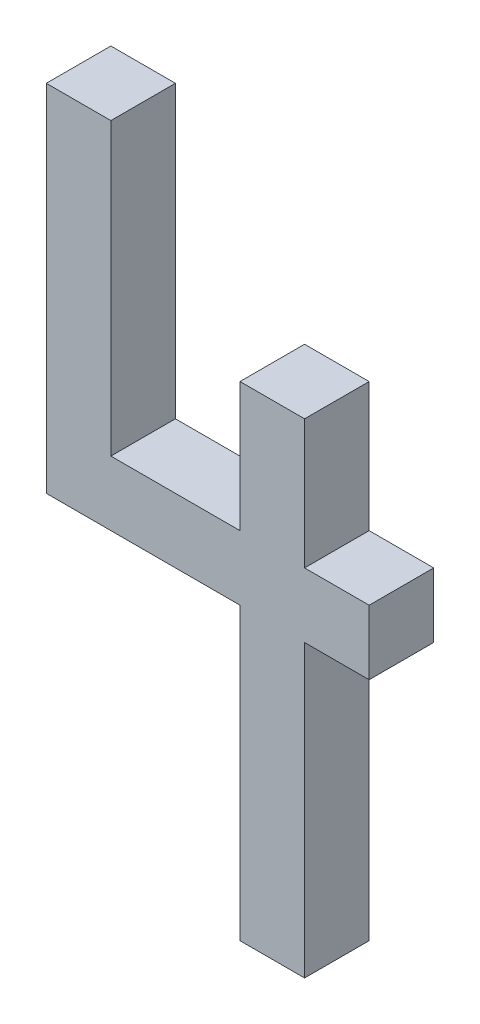
ISO-10303-21;
HEADER;
FILE_DESCRIPTION(('STEP AP214'),'2;1');
FILE_NAME('part.step','',(''),(''),'','','');
FILE_SCHEMA(('AUTOMOTIVE_DESIGN { 1 0 10303 214 1 1 1 1 }'));
ENDSEC;
DATA;
#1=APPLICATION_CONTEXT('core data for automotive mechanical design processes');
#2=APPLICATION_PROTOCOL_DEFINITION('international standard','automotive_design',2000,#1);
#3=PRODUCT_CONTEXT('',#1,'mechanical');
#4=PRODUCT('Part','Part','',(#3));
#5=PRODUCT_RELATED_PRODUCT_CATEGORY('part','',(#4));
#6=PRODUCT_DEFINITION_FORMATION('','',#4);
#7=PRODUCT_DEFINITION_CONTEXT('part definition',#1,'design');
#8=PRODUCT_DEFINITION('design','',#6,#7);
#9=PRODUCT_DEFINITION_SHAPE('','',#8);
#10=(LENGTH_UNIT() NAMED_UNIT(*) SI_UNIT(.MILLI.,.METRE.));
#11=(NAMED_UNIT(*) PLANE_ANGLE_UNIT() SI_UNIT($,.RADIAN.));
#12=(NAMED_UNIT(*) SI_UNIT($,.STERADIAN.) SOLID_ANGLE_UNIT());
#13=UNCERTAINTY_MEASURE_WITH_UNIT(LENGTH_MEASURE(1.E-05),#10,'distance_accuracy_value','');
#14=(GEOMETRIC_REPRESENTATION_CONTEXT(3) GLOBAL_UNCERTAINTY_ASSIGNED_CONTEXT((#13)) GLOBAL_UNIT_ASSIGNED_CONTEXT((#10,
#11,#12)) REPRESENTATION_CONTEXT('',''));
#15=CARTESIAN_POINT('',(0.,0.,0.));
#16=DIRECTION('',(0.,0.,1.));
#17=DIRECTION('',(1.,0.,0.));
#18=AXIS2_PLACEMENT_3D('',#15,#16,#17);
#19=CARTESIAN_POINT('',(-0.06349999999999,0.127,0.0254));
#20=DIRECTION('',(0.,0.,1.));
#21=DIRECTION('',(1.,0.,0.));
#22=AXIS2_PLACEMENT_3D('',#19,#20,#21);
#23=PLANE('',#22);
#24=DIRECTION('',(0.,1.,0.));
#25=VECTOR('',#24,1.);
#26=CARTESIAN_POINT('',(-0.0381,0.127,0.0254));
#27=LINE('',#26,#25);
#28=CARTESIAN_POINT('',(-0.0381,0.127,0.0254));
#29=VERTEX_POINT('',#28);
#30=CARTESIAN_POINT('',(-0.0381,0.0127,0.0254));
#31=VERTEX_POINT('',#30);
#32=EDGE_CURVE('E177',#29,#31,#27,.F.);
#33=ORIENTED_EDGE('',*,*,#32,.F.);
#34=DIRECTION('',(1.,0.,0.));
#35=VECTOR('',#34,1.);
#36=CARTESIAN_POINT('',(-0.06349999999999,0.127,0.0254));
#37=LINE('',#36,#35);
#38=CARTESIAN_POINT('',(-0.06349999999999,0.127,0.0254));
#39=VERTEX_POINT('',#38);
#40=EDGE_CURVE('E130',#39,#29,#37,.T.);
#41=ORIENTED_EDGE('',*,*,#40,.F.);
#42=DIRECTION('',(0.,1.,0.));
#43=VECTOR('',#42,1.);
#44=CARTESIAN_POINT('',(-0.06349999999999,-0.0127,0.0254));
#45=LINE('',#44,#43);
#46=CARTESIAN_POINT('',(-0.06349999999999,-0.0127,0.0254));
#47=VERTEX_POINT('',#46);
#48=EDGE_CURVE('E20',#47,#39,#45,.T.);
#49=ORIENTED_EDGE('',*,*,#48,.F.);
#50=DIRECTION('',(1.,0.,0.));
#51=VECTOR('',#50,1.);
#52=CARTESIAN_POINT('',(0.01270000000001,-0.0127,0.0254));
#53=LINE('',#52,#51);
#54=CARTESIAN_POINT('',(0.01270000000001,-0.0127,0.0254));
#55=VERTEX_POINT('',#54);
#56=EDGE_CURVE('E119',#55,#47,#53,.F.);
#57=ORIENTED_EDGE('',*,*,#56,.F.);
#58=DIRECTION('',(0.,1.,0.));
#59=VECTOR('',#58,1.);
#60=CARTESIAN_POINT('',(0.01270000000001,-0.127,0.0254));
#61=LINE('',#60,#59);
#62=CARTESIAN_POINT('',(0.01270000000001,-0.127,0.0254));
#63=VERTEX_POINT('',#62);
#64=EDGE_CURVE('E114',#63,#55,#61,.T.);
#65=ORIENTED_EDGE('',*,*,#64,.F.);
#66=DIRECTION('',(1.,0.,0.));
#67=VECTOR('',#66,1.);
#68=CARTESIAN_POINT('',(0.0381,-0.127,0.0254));
#69=LINE('',#68,#67);
#70=CARTESIAN_POINT('',(0.0381,-0.127,0.0254));
#71=VERTEX_POINT('',#70);
#72=EDGE_CURVE('E141',#71,#63,#69,.F.);
#73=ORIENTED_EDGE('',*,*,#72,.F.);
#74=DIRECTION('',(0.,1.,0.));
#75=VECTOR('',#74,1.);
#76=CARTESIAN_POINT('',(0.0381,-0.0127,0.0254));
#77=LINE('',#76,#75);
#78=CARTESIAN_POINT('',(0.0381,-0.0127,0.0254));
#79=VERTEX_POINT('',#78);
#80=EDGE_CURVE('E145',#79,#71,#77,.F.);
#81=ORIENTED_EDGE('',*,*,#80,.F.);
#82=DIRECTION('',(1.,0.,0.));
#83=VECTOR('',#82,1.);
#84=CARTESIAN_POINT('',(0.0635,-0.0127,0.0254));
#85=LINE('',#84,#83);
#86=CARTESIAN_POINT('',(0.0635,-0.0127,0.0254));
#87=VERTEX_POINT('',#86);
#88=EDGE_CURVE('E149',#87,#79,#85,.F.);
#89=ORIENTED_EDGE('',*,*,#88,.F.);
#90=DIRECTION('',(0.,1.,0.));
#91=VECTOR('',#90,1.);
#92=CARTESIAN_POINT('',(0.0635,0.0127,0.0254));
#93=LINE('',#92,#91);
#94=CARTESIAN_POINT('',(0.0635,0.0127,0.0254));
#95=VERTEX_POINT('',#94);
#96=EDGE_CURVE('E153',#95,#87,#93,.F.);
#97=ORIENTED_EDGE('',*,*,#96,.F.);
#98=DIRECTION('',(1.,0.,0.));
#99=VECTOR('',#98,1.);
#100=CARTESIAN_POINT('',(0.0381,0.0127,0.0254));
#101=LINE('',#100,#99);
#102=CARTESIAN_POINT('',(0.0381,0.0127,0.0254));
#103=VERTEX_POINT('',#102);
#104=EDGE_CURVE('E157',#103,#95,#101,.T.);
#105=ORIENTED_EDGE('',*,*,#104,.F.);
#106=DIRECTION('',(0.,1.,0.));
#107=VECTOR('',#106,1.);
#108=CARTESIAN_POINT('',(0.0381,0.0635,0.0254));
#109=LINE('',#108,#107);
#110=CARTESIAN_POINT('',(0.0381,0.0635,0.0254));
#111=VERTEX_POINT('',#110);
#112=EDGE_CURVE('E161',#111,#103,#109,.F.);
#113=ORIENTED_EDGE('',*,*,#112,.F.);
#114=DIRECTION('',(1.,0.,0.));
#115=VECTOR('',#114,1.);
#116=CARTESIAN_POINT('',(0.01270000000001,0.0635,0.0254));
#117=LINE('',#116,#115);
#118=CARTESIAN_POINT('',(0.01270000000001,0.0635,0.0254));
#119=VERTEX_POINT('',#118);
#120=EDGE_CURVE('E165',#119,#111,#117,.T.);
#121=ORIENTED_EDGE('',*,*,#120,.F.);
#122=DIRECTION('',(0.,1.,0.));
#123=VECTOR('',#122,1.);
#124=CARTESIAN_POINT('',(0.01270000000001,0.0127,0.0254));
#125=LINE('',#124,#123);
#126=CARTESIAN_POINT('',(0.01270000000001,0.0127,0.0254));
#127=VERTEX_POINT('',#126);
#128=EDGE_CURVE('E169',#127,#119,#125,.T.);
#129=ORIENTED_EDGE('',*,*,#128,.F.);
#130=DIRECTION('',(1.,0.,0.));
#131=VECTOR('',#130,1.);
#132=CARTESIAN_POINT('',(-0.0381,0.0127,0.0254));
#133=LINE('',#132,#131);
#134=EDGE_CURVE('E173',#31,#127,#133,.T.);
#135=ORIENTED_EDGE('',*,*,#134,.F.);
#136=EDGE_LOOP('',(#33,#41,#49,#57,#65,#73,#81,#89,#97,#105,#113,#121,#129,#135));
#137=FACE_BOUND('',#136,.T.);
#138=ADVANCED_FACE('F17',(#137),#23,.T.);
#139=CARTESIAN_POINT('',(-0.06349999999999,-0.0127,0.));
#140=DIRECTION('',(-1.,0.,0.));
#141=DIRECTION('',(0.,0.,1.));
#142=AXIS2_PLACEMENT_3D('',#139,#140,#141);
#143=PLANE('',#142);
#144=DIRECTION('',(0.,0.,1.));
#145=VECTOR('',#144,1.);
#146=CARTESIAN_POINT('',(-0.06349999999999,0.127,0.));
#147=LINE('',#146,#145);
#148=CARTESIAN_POINT('',(-0.06349999999999,0.127,0.));
#149=VERTEX_POINT('',#148);
#150=EDGE_CURVE('E181',#149,#39,#147,.T.);
#151=ORIENTED_EDGE('',*,*,#150,.F.);
#152=DIRECTION('',(0.,1.,0.));
#153=VECTOR('',#152,1.);
#154=CARTESIAN_POINT('',(-0.06349999999999,0.127,0.));
#155=LINE('',#154,#153);
#156=CARTESIAN_POINT('',(-0.06349999999999,-0.0127,0.));
#157=VERTEX_POINT('',#156);
#158=EDGE_CURVE('E136',#149,#157,#155,.F.);
#159=ORIENTED_EDGE('',*,*,#158,.T.);
#160=DIRECTION('',(0.,0.,-1.));
#161=VECTOR('',#160,1.);
#162=CARTESIAN_POINT('',(-0.06349999999999,-0.0127,0.));
#163=LINE('',#162,#161);
#164=EDGE_CURVE('E124',#47,#157,#163,.T.);
#165=ORIENTED_EDGE('',*,*,#164,.F.);
#166=ORIENTED_EDGE('',*,*,#48,.T.);
#167=EDGE_LOOP('',(#151,#159,#165,#166));
#168=FACE_BOUND('',#167,.T.);
#169=ADVANCED_FACE('F135',(#168),#143,.T.);
#170=CARTESIAN_POINT('',(0.01270000000001,-0.0127,0.));
#171=DIRECTION('',(0.,-1.,0.));
#172=DIRECTION('',(0.,0.,-1.));
#173=AXIS2_PLACEMENT_3D('',#170,#171,#172);
#174=PLANE('',#173);
#175=ORIENTED_EDGE('',*,*,#164,.T.);
#176=DIRECTION('',(1.,0.,0.));
#177=VECTOR('',#176,1.);
#178=CARTESIAN_POINT('',(-0.06349999999999,-0.0127,0.));
#179=LINE('',#178,#177);
#180=CARTESIAN_POINT('',(0.01270000000001,-0.0127,0.));
#181=VERTEX_POINT('',#180);
#182=EDGE_CURVE('E186',#157,#181,#179,.T.);
#183=ORIENTED_EDGE('',*,*,#182,.T.);
#184=DIRECTION('',(0.,0.,1.));
#185=VECTOR('',#184,1.);
#186=CARTESIAN_POINT('',(0.01270000000001,-0.0127,0.));
#187=LINE('',#186,#185);
#188=EDGE_CURVE('E126',#55,#181,#187,.F.);
#189=ORIENTED_EDGE('',*,*,#188,.F.);
#190=ORIENTED_EDGE('',*,*,#56,.T.);
#191=EDGE_LOOP('',(#175,#183,#189,#190));
#192=FACE_BOUND('',#191,.T.);
#193=ADVANCED_FACE('F121',(#192),#174,.T.);
#194=CARTESIAN_POINT('',(0.01270000000001,-0.127,0.));
#195=DIRECTION('',(-1.,0.,0.));
#196=DIRECTION('',(0.,0.,1.));
#197=AXIS2_PLACEMENT_3D('',#194,#195,#196);
#198=PLANE('',#197);
#199=ORIENTED_EDGE('',*,*,#188,.T.);
#200=DIRECTION('',(0.,1.,0.));
#201=VECTOR('',#200,1.);
#202=CARTESIAN_POINT('',(0.01270000000001,0.127,0.));
#203=LINE('',#202,#201);
#204=CARTESIAN_POINT('',(0.01270000000001,-0.127,0.));
#205=VERTEX_POINT('',#204);
#206=EDGE_CURVE('E188',#181,#205,#203,.F.);
#207=ORIENTED_EDGE('',*,*,#206,.T.);
#208=DIRECTION('',(0.,0.,-1.));
#209=VECTOR('',#208,1.);
#210=CARTESIAN_POINT('',(0.01270000000001,-0.127,0.));
#211=LINE('',#210,#209);
#212=EDGE_CURVE('E143',#63,#205,#211,.T.);
#213=ORIENTED_EDGE('',*,*,#212,.F.);
#214=ORIENTED_EDGE('',*,*,#64,.T.);
#215=EDGE_LOOP('',(#199,#207,#213,#214));
#216=FACE_BOUND('',#215,.T.);
#217=ADVANCED_FACE('F270',(#216),#198,.T.);
#218=CARTESIAN_POINT('',(0.0381,-0.127,0.));
#219=DIRECTION('',(0.,-1.,0.));
#220=DIRECTION('',(0.,0.,-1.));
#221=AXIS2_PLACEMENT_3D('',#218,#219,#220);
#222=PLANE('',#221);
#223=ORIENTED_EDGE('',*,*,#212,.T.);
#224=DIRECTION('',(1.,0.,0.));
#225=VECTOR('',#224,1.);
#226=CARTESIAN_POINT('',(-0.06349999999999,-0.127,0.));
#227=LINE('',#226,#225);
#228=CARTESIAN_POINT('',(0.0381,-0.127,0.));
#229=VERTEX_POINT('',#228);
#230=EDGE_CURVE('E191',#205,#229,#227,.T.);
#231=ORIENTED_EDGE('',*,*,#230,.T.);
#232=DIRECTION('',(0.,0.,-1.));
#233=VECTOR('',#232,1.);
#234=CARTESIAN_POINT('',(0.0381,-0.127,0.));
#235=LINE('',#234,#233);
#236=EDGE_CURVE('E147',#71,#229,#235,.T.);
#237=ORIENTED_EDGE('',*,*,#236,.F.);
#238=ORIENTED_EDGE('',*,*,#72,.T.);
#239=EDGE_LOOP('',(#223,#231,#237,#238));
#240=FACE_BOUND('',#239,.T.);
#241=ADVANCED_FACE('F269',(#240),#222,.T.);
#242=CARTESIAN_POINT('',(0.0381,-0.0127,0.));
#243=DIRECTION('',(1.,0.,0.));
#244=DIRECTION('',(0.,0.,-1.));
#245=AXIS2_PLACEMENT_3D('',#242,#243,#244);
#246=PLANE('',#245);
#247=ORIENTED_EDGE('',*,*,#236,.T.);
#248=DIRECTION('',(0.,1.,0.));
#249=VECTOR('',#248,1.);
#250=CARTESIAN_POINT('',(0.0381,0.127,0.));
#251=LINE('',#250,#249);
#252=CARTESIAN_POINT('',(0.0381,-0.0127,0.));
#253=VERTEX_POINT('',#252);
#254=EDGE_CURVE('E194',#229,#253,#251,.T.);
#255=ORIENTED_EDGE('',*,*,#254,.T.);
#256=DIRECTION('',(0.,0.,-1.));
#257=VECTOR('',#256,1.);
#258=CARTESIAN_POINT('',(0.0381,-0.0127,0.));
#259=LINE('',#258,#257);
#260=EDGE_CURVE('E151',#79,#253,#259,.T.);
#261=ORIENTED_EDGE('',*,*,#260,.F.);
#262=ORIENTED_EDGE('',*,*,#80,.T.);
#263=EDGE_LOOP('',(#247,#255,#261,#262));
#264=FACE_BOUND('',#263,.T.);
#265=ADVANCED_FACE('F263',(#264),#246,.T.);
#266=CARTESIAN_POINT('',(0.0635,-0.0127,0.));
#267=DIRECTION('',(0.,-1.,0.));
#268=DIRECTION('',(0.,0.,-1.));
#269=AXIS2_PLACEMENT_3D('',#266,#267,#268);
#270=PLANE('',#269);
#271=ORIENTED_EDGE('',*,*,#260,.T.);
#272=DIRECTION('',(1.,0.,0.));
#273=VECTOR('',#272,1.);
#274=CARTESIAN_POINT('',(-0.06349999999999,-0.0127,0.));
#275=LINE('',#274,#273);
#276=CARTESIAN_POINT('',(0.0635,-0.0127,0.));
#277=VERTEX_POINT('',#276);
#278=EDGE_CURVE('E197',#253,#277,#275,.T.);
#279=ORIENTED_EDGE('',*,*,#278,.T.);
#280=DIRECTION('',(0.,0.,-1.));
#281=VECTOR('',#280,1.);
#282=CARTESIAN_POINT('',(0.0635,-0.0127,0.));
#283=LINE('',#282,#281);
#284=EDGE_CURVE('E155',#87,#277,#283,.T.);
#285=ORIENTED_EDGE('',*,*,#284,.F.);
#286=ORIENTED_EDGE('',*,*,#88,.T.);
#287=EDGE_LOOP('',(#271,#279,#285,#286));
#288=FACE_BOUND('',#287,.T.);
#289=ADVANCED_FACE('F259',(#288),#270,.T.);
#290=CARTESIAN_POINT('',(0.0635,0.0127,0.));
#291=DIRECTION('',(1.,0.,0.));
#292=DIRECTION('',(0.,0.,-1.));
#293=AXIS2_PLACEMENT_3D('',#290,#291,#292);
#294=PLANE('',#293);
#295=ORIENTED_EDGE('',*,*,#284,.T.);
#296=DIRECTION('',(0.,1.,0.));
#297=VECTOR('',#296,1.);
#298=CARTESIAN_POINT('',(0.0635,0.127,0.));
#299=LINE('',#298,#297);
#300=CARTESIAN_POINT('',(0.0635,0.0127,0.));
#301=VERTEX_POINT('',#300);
#302=EDGE_CURVE('E200',#277,#301,#299,.T.);
#303=ORIENTED_EDGE('',*,*,#302,.T.);
#304=DIRECTION('',(0.,0.,1.));
#305=VECTOR('',#304,1.);
#306=CARTESIAN_POINT('',(0.0635,0.0127,0.));
#307=LINE('',#306,#305);
#308=EDGE_CURVE('E159',#95,#301,#307,.F.);
#309=ORIENTED_EDGE('',*,*,#308,.F.);
#310=ORIENTED_EDGE('',*,*,#96,.T.);
#311=EDGE_LOOP('',(#295,#303,#309,#310));
#312=FACE_BOUND('',#311,.T.);
#313=ADVANCED_FACE('F253',(#312),#294,.T.);
#314=CARTESIAN_POINT('',(0.0381,0.0127,0.));
#315=DIRECTION('',(0.,1.,0.));
#316=DIRECTION('',(0.,0.,1.));
#317=AXIS2_PLACEMENT_3D('',#314,#315,#316);
#318=PLANE('',#317);
#319=ORIENTED_EDGE('',*,*,#308,.T.);
#320=DIRECTION('',(1.,0.,0.));
#321=VECTOR('',#320,1.);
#322=CARTESIAN_POINT('',(-0.06349999999999,0.0127,0.));
#323=LINE('',#322,#321);
#324=CARTESIAN_POINT('',(0.0381,0.0127,0.));
#325=VERTEX_POINT('',#324);
#326=EDGE_CURVE('E203',#301,#325,#323,.F.);
#327=ORIENTED_EDGE('',*,*,#326,.T.);
#328=DIRECTION('',(0.,0.,-1.));
#329=VECTOR('',#328,1.);
#330=CARTESIAN_POINT('',(0.0381,0.0127,0.));
#331=LINE('',#330,#329);
#332=EDGE_CURVE('E163',#103,#325,#331,.T.);
#333=ORIENTED_EDGE('',*,*,#332,.F.);
#334=ORIENTED_EDGE('',*,*,#104,.T.);
#335=EDGE_LOOP('',(#319,#327,#333,#334));
#336=FACE_BOUND('',#335,.T.);
#337=ADVANCED_FACE('F249',(#336),#318,.T.);
#338=CARTESIAN_POINT('',(0.0381,0.0635,0.));
#339=DIRECTION('',(1.,0.,0.));
#340=DIRECTION('',(0.,0.,-1.));
#341=AXIS2_PLACEMENT_3D('',#338,#339,#340);
#342=PLANE('',#341);
#343=ORIENTED_EDGE('',*,*,#332,.T.);
#344=DIRECTION('',(0.,1.,0.));
#345=VECTOR('',#344,1.);
#346=CARTESIAN_POINT('',(0.0381,0.127,0.));
#347=LINE('',#346,#345);
#348=CARTESIAN_POINT('',(0.0381,0.0635,0.));
#349=VERTEX_POINT('',#348);
#350=EDGE_CURVE('E206',#325,#349,#347,.T.);
#351=ORIENTED_EDGE('',*,*,#350,.T.);
#352=DIRECTION('',(0.,0.,1.));
#353=VECTOR('',#352,1.);
#354=CARTESIAN_POINT('',(0.0381,0.0635,0.));
#355=LINE('',#354,#353);
#356=EDGE_CURVE('E167',#111,#349,#355,.F.);
#357=ORIENTED_EDGE('',*,*,#356,.F.);
#358=ORIENTED_EDGE('',*,*,#112,.T.);
#359=EDGE_LOOP('',(#343,#351,#357,#358));
#360=FACE_BOUND('',#359,.T.);
#361=ADVANCED_FACE('F243',(#360),#342,.T.);
#362=CARTESIAN_POINT('',(0.01270000000001,0.0635,0.));
#363=DIRECTION('',(0.,1.,0.));
#364=DIRECTION('',(0.,0.,1.));
#365=AXIS2_PLACEMENT_3D('',#362,#363,#364);
#366=PLANE('',#365);
#367=ORIENTED_EDGE('',*,*,#356,.T.);
#368=DIRECTION('',(1.,0.,0.));
#369=VECTOR('',#368,1.);
#370=CARTESIAN_POINT('',(-0.06349999999999,0.0635,0.));
#371=LINE('',#370,#369);
#372=CARTESIAN_POINT('',(0.01270000000001,0.0635,0.));
#373=VERTEX_POINT('',#372);
#374=EDGE_CURVE('E209',#349,#373,#371,.F.);
#375=ORIENTED_EDGE('',*,*,#374,.T.);
#376=DIRECTION('',(0.,0.,1.));
#377=VECTOR('',#376,1.);
#378=CARTESIAN_POINT('',(0.01270000000001,0.0635,0.));
#379=LINE('',#378,#377);
#380=EDGE_CURVE('E171',#119,#373,#379,.F.);
#381=ORIENTED_EDGE('',*,*,#380,.F.);
#382=ORIENTED_EDGE('',*,*,#120,.T.);
#383=EDGE_LOOP('',(#367,#375,#381,#382));
#384=FACE_BOUND('',#383,.T.);
#385=ADVANCED_FACE('F239',(#384),#366,.T.);
#386=CARTESIAN_POINT('',(0.01270000000001,0.0127,0.));
#387=DIRECTION('',(-1.,0.,0.));
#388=DIRECTION('',(0.,0.,1.));
#389=AXIS2_PLACEMENT_3D('',#386,#387,#388);
#390=PLANE('',#389);
#391=ORIENTED_EDGE('',*,*,#380,.T.);
#392=DIRECTION('',(0.,1.,0.));
#393=VECTOR('',#392,1.);
#394=CARTESIAN_POINT('',(0.01270000000001,0.127,0.));
#395=LINE('',#394,#393);
#396=CARTESIAN_POINT('',(0.01270000000001,0.0127,0.));
#397=VERTEX_POINT('',#396);
#398=EDGE_CURVE('E212',#373,#397,#395,.F.);
#399=ORIENTED_EDGE('',*,*,#398,.T.);
#400=DIRECTION('',(0.,0.,1.));
#401=VECTOR('',#400,1.);
#402=CARTESIAN_POINT('',(0.01270000000001,0.0127,0.));
#403=LINE('',#402,#401);
#404=EDGE_CURVE('E175',#127,#397,#403,.F.);
#405=ORIENTED_EDGE('',*,*,#404,.F.);
#406=ORIENTED_EDGE('',*,*,#128,.T.);
#407=EDGE_LOOP('',(#391,#399,#405,#406));
#408=FACE_BOUND('',#407,.T.);
#409=ADVANCED_FACE('F233',(#408),#390,.T.);
#410=CARTESIAN_POINT('',(-0.0381,0.0127,0.));
#411=DIRECTION('',(0.,1.,0.));
#412=DIRECTION('',(0.,0.,1.));
#413=AXIS2_PLACEMENT_3D('',#410,#411,#412);
#414=PLANE('',#413);
#415=ORIENTED_EDGE('',*,*,#404,.T.);
#416=DIRECTION('',(1.,0.,0.));
#417=VECTOR('',#416,1.);
#418=CARTESIAN_POINT('',(-0.06349999999999,0.0127,0.));
#419=LINE('',#418,#417);
#420=CARTESIAN_POINT('',(-0.0381,0.0127,0.));
#421=VERTEX_POINT('',#420);
#422=EDGE_CURVE('E215',#397,#421,#419,.F.);
#423=ORIENTED_EDGE('',*,*,#422,.T.);
#424=DIRECTION('',(0.,0.,-1.));
#425=VECTOR('',#424,1.);
#426=CARTESIAN_POINT('',(-0.0381,0.0127,0.));
#427=LINE('',#426,#425);
#428=EDGE_CURVE('E179',#31,#421,#427,.T.);
#429=ORIENTED_EDGE('',*,*,#428,.F.);
#430=ORIENTED_EDGE('',*,*,#134,.T.);
#431=EDGE_LOOP('',(#415,#423,#429,#430));
#432=FACE_BOUND('',#431,.T.);
#433=ADVANCED_FACE('F228',(#432),#414,.T.);
#434=CARTESIAN_POINT('',(-0.0381,0.127,0.));
#435=DIRECTION('',(1.,0.,0.));
#436=DIRECTION('',(0.,0.,-1.));
#437=AXIS2_PLACEMENT_3D('',#434,#435,#436);
#438=PLANE('',#437);
#439=ORIENTED_EDGE('',*,*,#428,.T.);
#440=DIRECTION('',(0.,1.,0.));
#441=VECTOR('',#440,1.);
#442=CARTESIAN_POINT('',(-0.0381,0.127,0.));
#443=LINE('',#442,#441);
#444=CARTESIAN_POINT('',(-0.0381,0.127,0.));
#445=VERTEX_POINT('',#444);
#446=EDGE_CURVE('E26',#421,#445,#443,.T.);
#447=ORIENTED_EDGE('',*,*,#446,.T.);
#448=DIRECTION('',(0.,0.,1.));
#449=VECTOR('',#448,1.);
#450=CARTESIAN_POINT('',(-0.0381,0.127,0.));
#451=LINE('',#450,#449);
#452=EDGE_CURVE('E34',#29,#445,#451,.F.);
#453=ORIENTED_EDGE('',*,*,#452,.F.);
#454=ORIENTED_EDGE('',*,*,#32,.T.);
#455=EDGE_LOOP('',(#439,#447,#453,#454));
#456=FACE_BOUND('',#455,.T.);
#457=ADVANCED_FACE('F221',(#456),#438,.T.);
#458=CARTESIAN_POINT('',(-0.06349999999999,0.127,0.));
#459=DIRECTION('',(0.,1.,0.));
#460=DIRECTION('',(0.,0.,1.));
#461=AXIS2_PLACEMENT_3D('',#458,#459,#460);
#462=PLANE('',#461);
#463=ORIENTED_EDGE('',*,*,#452,.T.);
#464=DIRECTION('',(1.,0.,0.));
#465=VECTOR('',#464,1.);
#466=CARTESIAN_POINT('',(-0.06349999999999,0.127,0.));
#467=LINE('',#466,#465);
#468=EDGE_CURVE('E11',#445,#149,#467,.F.);
#469=ORIENTED_EDGE('',*,*,#468,.T.);
#470=ORIENTED_EDGE('',*,*,#150,.T.);
#471=ORIENTED_EDGE('',*,*,#40,.T.);
#472=EDGE_LOOP('',(#463,#469,#470,#471));
#473=FACE_BOUND('',#472,.T.);
#474=ADVANCED_FACE('F271',(#473),#462,.T.);
#475=CARTESIAN_POINT('',(-0.06349999999999,0.127,0.));
#476=DIRECTION('',(0.,0.,1.));
#477=DIRECTION('',(1.,0.,0.));
#478=AXIS2_PLACEMENT_3D('',#475,#476,#477);
#479=PLANE('',#478);
#480=ORIENTED_EDGE('',*,*,#446,.F.);
#481=ORIENTED_EDGE('',*,*,#422,.F.);
#482=ORIENTED_EDGE('',*,*,#398,.F.);
#483=ORIENTED_EDGE('',*,*,#374,.F.);
#484=ORIENTED_EDGE('',*,*,#350,.F.);
#485=ORIENTED_EDGE('',*,*,#326,.F.);
#486=ORIENTED_EDGE('',*,*,#302,.F.);
#487=ORIENTED_EDGE('',*,*,#278,.F.);
#488=ORIENTED_EDGE('',*,*,#254,.F.);
#489=ORIENTED_EDGE('',*,*,#230,.F.);
#490=ORIENTED_EDGE('',*,*,#206,.F.);
#491=ORIENTED_EDGE('',*,*,#182,.F.);
#492=ORIENTED_EDGE('',*,*,#158,.F.);
#493=ORIENTED_EDGE('',*,*,#468,.F.);
#494=EDGE_LOOP('',(#480,#481,#482,#483,#484,#485,#486,#487,#488,#489,#490,#491,#492,#493));
#495=FACE_BOUND('',#494,.T.);
#496=ADVANCED_FACE('F225',(#495),#479,.F.);
#497=CLOSED_SHELL('',(#138,#169,#193,#217,#241,#265,#289,#313,#337,#361,#385,#409,#433,#457,
#474,#496));
#498=MANIFOLD_SOLID_BREP('B1',#497);
#499=ADVANCED_BREP_SHAPE_REPRESENTATION('',(#18,#498),#14);
#500=SHAPE_DEFINITION_REPRESENTATION(#9,#499);
ENDSEC;
END-ISO-10303-21;
